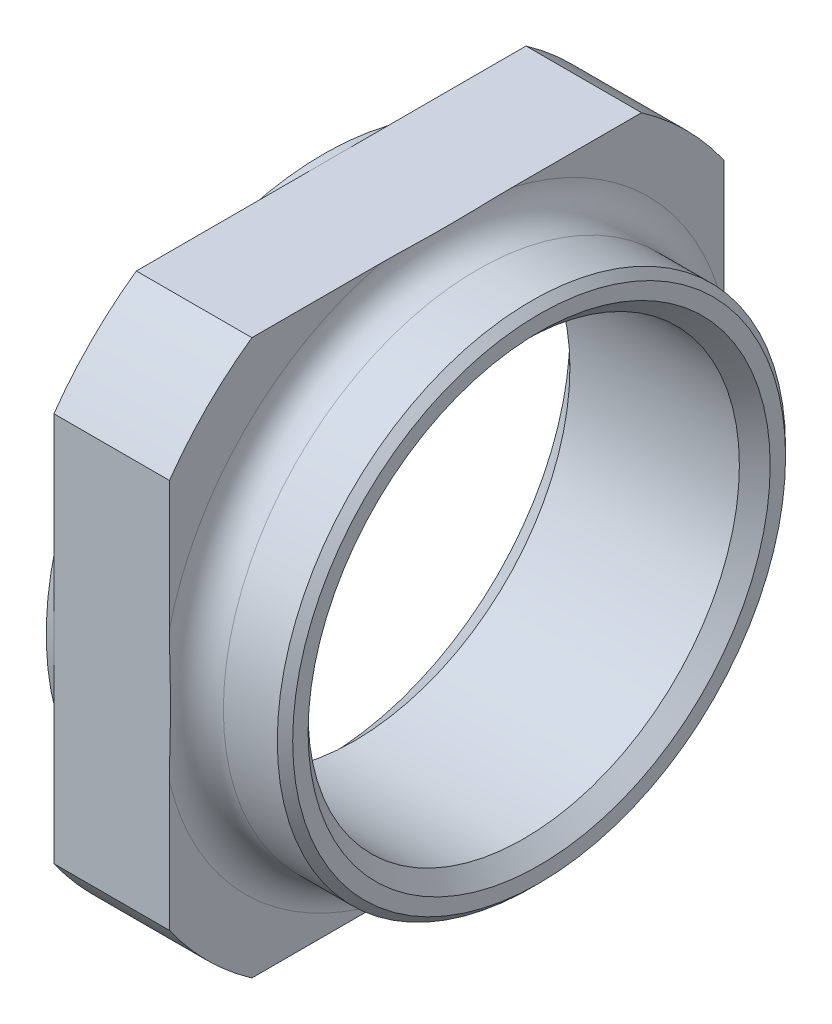
ISO-10303-21;
HEADER;
FILE_DESCRIPTION(('STEP AP214'),'2;1');
FILE_NAME('part.step','',(''),(''),'','','');
FILE_SCHEMA(('AUTOMOTIVE_DESIGN { 1 0 10303 214 1 1 1 1 }'));
ENDSEC;
DATA;
#1=APPLICATION_CONTEXT('core data for automotive mechanical design processes');
#2=APPLICATION_PROTOCOL_DEFINITION('international standard','automotive_design',2000,#1);
#3=PRODUCT_CONTEXT('',#1,'mechanical');
#4=PRODUCT('Part','Part','',(#3));
#5=PRODUCT_RELATED_PRODUCT_CATEGORY('part','',(#4));
#6=PRODUCT_DEFINITION_FORMATION('','',#4);
#7=PRODUCT_DEFINITION_CONTEXT('part definition',#1,'design');
#8=PRODUCT_DEFINITION('design','',#6,#7);
#9=PRODUCT_DEFINITION_SHAPE('','',#8);
#10=(LENGTH_UNIT() NAMED_UNIT(*) SI_UNIT(.MILLI.,.METRE.));
#11=(NAMED_UNIT(*) PLANE_ANGLE_UNIT() SI_UNIT($,.RADIAN.));
#12=(NAMED_UNIT(*) SI_UNIT($,.STERADIAN.) SOLID_ANGLE_UNIT());
#13=UNCERTAINTY_MEASURE_WITH_UNIT(LENGTH_MEASURE(1.E-05),#10,'distance_accuracy_value','');
#14=(GEOMETRIC_REPRESENTATION_CONTEXT(3) GLOBAL_UNCERTAINTY_ASSIGNED_CONTEXT((#13)) GLOBAL_UNIT_ASSIGNED_CONTEXT((#10,
#11,#12)) REPRESENTATION_CONTEXT('',''));
#15=CARTESIAN_POINT('',(0.,0.,0.));
#16=DIRECTION('',(0.,0.,1.));
#17=DIRECTION('',(1.,0.,0.));
#18=AXIS2_PLACEMENT_3D('',#15,#16,#17);
#19=CARTESIAN_POINT('',(88.9943089574791,18.4998225037,0.));
#20=DIRECTION('',(-1.,0.,0.));
#21=DIRECTION('',(0.,0.,1.));
#22=AXIS2_PLACEMENT_3D('',#19,#20,#21);
#23=PLANE('',#22);
#24=CARTESIAN_POINT('',(88.9943089574791,0.,0.));
#25=DIRECTION('',(1.,0.,0.));
#26=DIRECTION('',(0.,0.972982308144447,0.230879683034051));
#27=AXIS2_PLACEMENT_3D('',#24,#25,#26);
#28=CIRCLE('',#27,18.4998225037757);
#29=CARTESIAN_POINT('',(88.9943089574791,4.2712331558,18.));
#30=VERTEX_POINT('',#29);
#31=CARTESIAN_POINT('',(88.9943089574791,17.9999999997573,4.27123315580359));
#32=VERTEX_POINT('',#31);
#33=EDGE_CURVE('E107',#30,#32,#28,.F.);
#34=ORIENTED_EDGE('',*,*,#33,.T.);
#35=DIRECTION('',(0.,0.,1.));
#36=VECTOR('',#35,1.);
#37=CARTESIAN_POINT('',(88.9943089574791,17.9999999997,-18.));
#38=LINE('',#37,#36);
#39=CARTESIAN_POINT('',(88.9943089574791,17.9999999997,12.6488019276156));
#40=VERTEX_POINT('',#39);
#41=EDGE_CURVE('E145',#40,#32,#38,.F.);
#42=ORIENTED_EDGE('',*,*,#41,.F.);
#43=CARTESIAN_POINT('',(88.9943089574791,0.,0.));
#44=DIRECTION('',(1.,0.,0.));
#45=DIRECTION('',(0.,0.,-1.));
#46=AXIS2_PLACEMENT_3D('',#43,#44,#45);
#47=CIRCLE('',#46,21.9998225038);
#48=CARTESIAN_POINT('',(88.9943089574791,12.6488019274021,18.));
#49=VERTEX_POINT('',#48);
#50=EDGE_CURVE('E326',#49,#40,#47,.F.);
#51=ORIENTED_EDGE('',*,*,#50,.F.);
#52=DIRECTION('',(0.,1.,0.));
#53=VECTOR('',#52,1.);
#54=CARTESIAN_POINT('',(88.9943089574791,17.9999999997,18.));
#55=LINE('',#54,#53);
#56=EDGE_CURVE('E99',#30,#49,#55,.T.);
#57=ORIENTED_EDGE('',*,*,#56,.F.);
#58=EDGE_LOOP('',(#34,#42,#51,#57));
#59=FACE_BOUND('',#58,.T.);
#60=ADVANCED_FACE('F17',(#59),#23,.F.);
#61=CARTESIAN_POINT('',(88.9943089574791,18.4998225037,0.));
#62=DIRECTION('',(-1.,0.,0.));
#63=DIRECTION('',(0.,0.,1.));
#64=AXIS2_PLACEMENT_3D('',#61,#62,#63);
#65=PLANE('',#64);
#66=DIRECTION('',(0.,0.,-1.));
#67=VECTOR('',#66,1.);
#68=CARTESIAN_POINT('',(88.9943089574791,-18.,18.));
#69=LINE('',#68,#67);
#70=CARTESIAN_POINT('',(88.9943089574791,-18.,-12.6488019274021));
#71=VERTEX_POINT('',#70);
#72=CARTESIAN_POINT('',(88.9943089574791,-18.0000000000005,-4.2712331557901));
#73=VERTEX_POINT('',#72);
#74=EDGE_CURVE('E230',#71,#73,#69,.F.);
#75=ORIENTED_EDGE('',*,*,#74,.F.);
#76=CARTESIAN_POINT('',(88.9943089574791,0.,0.));
#77=DIRECTION('',(1.,0.,0.));
#78=DIRECTION('',(0.,0.,-1.));
#79=AXIS2_PLACEMENT_3D('',#76,#77,#78);
#80=CIRCLE('',#79,21.9998225038);
#81=CARTESIAN_POINT('',(88.9943089574791,-12.6488019273521,-18.));
#82=VERTEX_POINT('',#81);
#83=EDGE_CURVE('E220',#82,#71,#80,.F.);
#84=ORIENTED_EDGE('',*,*,#83,.F.);
#85=DIRECTION('',(0.,1.,0.));
#86=VECTOR('',#85,1.);
#87=CARTESIAN_POINT('',(88.9943089574791,-18.,-18.));
#88=LINE('',#87,#86);
#89=CARTESIAN_POINT('',(88.9943089574791,-4.2712331558,-18.));
#90=VERTEX_POINT('',#89);
#91=EDGE_CURVE('E233',#90,#82,#88,.F.);
#92=ORIENTED_EDGE('',*,*,#91,.F.);
#93=CARTESIAN_POINT('',(88.9943089574791,0.,0.));
#94=DIRECTION('',(1.,0.,0.));
#95=DIRECTION('',(0.,-0.972982308145312,-0.230879683030408));
#96=AXIS2_PLACEMENT_3D('',#93,#94,#95);
#97=CIRCLE('',#96,18.4998225037757);
#98=EDGE_CURVE('E344',#90,#73,#97,.F.);
#99=ORIENTED_EDGE('',*,*,#98,.T.);
#100=EDGE_LOOP('',(#75,#84,#92,#99));
#101=FACE_BOUND('',#100,.T.);
#102=ADVANCED_FACE('F343',(#101),#65,.F.);
#103=CARTESIAN_POINT('',(88.9943089574791,18.4998225037,0.));
#104=DIRECTION('',(-1.,0.,0.));
#105=DIRECTION('',(0.,0.,1.));
#106=AXIS2_PLACEMENT_3D('',#103,#104,#105);
#107=PLANE('',#106);
#108=CARTESIAN_POINT('',(88.9943089574791,0.,0.));
#109=DIRECTION('',(1.,0.,0.));
#110=DIRECTION('',(0.,0.,-1.));
#111=AXIS2_PLACEMENT_3D('',#108,#109,#110);
#112=CIRCLE('',#111,21.9998225038);
#113=CARTESIAN_POINT('',(88.9943089574791,-18.000000000001,12.6488019274028));
#114=VERTEX_POINT('',#113);
#115=CARTESIAN_POINT('',(88.9943089574791,-12.6488019273521,18.));
#116=VERTEX_POINT('',#115);
#117=EDGE_CURVE('E176',#114,#116,#112,.F.);
#118=ORIENTED_EDGE('',*,*,#117,.F.);
#119=DIRECTION('',(0.,0.,-1.));
#120=VECTOR('',#119,1.);
#121=CARTESIAN_POINT('',(88.9943089574791,-18.,18.));
#122=LINE('',#121,#120);
#123=CARTESIAN_POINT('',(88.9943089574791,-18.,4.27123315579));
#124=VERTEX_POINT('',#123);
#125=EDGE_CURVE('E243',#124,#114,#122,.F.);
#126=ORIENTED_EDGE('',*,*,#125,.F.);
#127=CARTESIAN_POINT('',(88.9943089574791,0.,0.));
#128=DIRECTION('',(1.,0.,0.));
#129=DIRECTION('',(0.,-0.877582561890723,0.479425538603562));
#130=AXIS2_PLACEMENT_3D('',#127,#128,#129);
#131=CIRCLE('',#130,18.4998225037734);
#132=CARTESIAN_POINT('',(88.9943089574791,-16.2351216273956,8.86928736795146));
#133=VERTEX_POINT('',#132);
#134=EDGE_CURVE('E457',#124,#133,#131,.F.);
#135=ORIENTED_EDGE('',*,*,#134,.T.);
#136=CARTESIAN_POINT('',(88.9943089574791,0.,0.));
#137=DIRECTION('',(1.,0.,0.));
#138=DIRECTION('',(0.,-0.23087968303092,0.97298230814519));
#139=AXIS2_PLACEMENT_3D('',#136,#137,#138);
#140=CIRCLE('',#139,18.4998225037952);
#141=CARTESIAN_POINT('',(88.9943089574791,-4.2712331558009,18.0000000000038));
#142=VERTEX_POINT('',#141);
#143=EDGE_CURVE('E153',#133,#142,#140,.F.);
#144=ORIENTED_EDGE('',*,*,#143,.T.);
#145=DIRECTION('',(0.,1.,0.));
#146=VECTOR('',#145,1.);
#147=CARTESIAN_POINT('',(88.9943089574791,17.9999999997,18.));
#148=LINE('',#147,#146);
#149=EDGE_CURVE('E253',#116,#142,#148,.T.);
#150=ORIENTED_EDGE('',*,*,#149,.F.);
#151=EDGE_LOOP('',(#118,#126,#135,#144,#150));
#152=FACE_BOUND('',#151,.T.);
#153=ADVANCED_FACE('F197',(#152),#107,.F.);
#154=CARTESIAN_POINT('',(88.9943089574791,18.4998225037,0.));
#155=DIRECTION('',(-1.,0.,0.));
#156=DIRECTION('',(0.,0.,1.));
#157=AXIS2_PLACEMENT_3D('',#154,#155,#156);
#158=PLANE('',#157);
#159=CARTESIAN_POINT('',(88.9943089574791,0.,0.));
#160=DIRECTION('',(1.,0.,0.));
#161=DIRECTION('',(0.,0.877582561890372,-0.479425538604203));
#162=AXIS2_PLACEMENT_3D('',#159,#160,#161);
#163=CIRCLE('',#162,18.4998225034815);
#164=CARTESIAN_POINT('',(88.9943089574791,17.9999999997,-4.27123315579));
#165=VERTEX_POINT('',#164);
#166=CARTESIAN_POINT('',(88.9943089574791,16.2351216273436,-8.86928736792842));
#167=VERTEX_POINT('',#166);
#168=EDGE_CURVE('E136',#165,#167,#163,.F.);
#169=ORIENTED_EDGE('',*,*,#168,.T.);
#170=CARTESIAN_POINT('',(88.9943089574791,0.,0.));
#171=DIRECTION('',(1.,0.,0.));
#172=DIRECTION('',(0.,0.23087968303092,-0.97298230814519));
#173=AXIS2_PLACEMENT_3D('',#170,#171,#172);
#174=CIRCLE('',#173,18.4998225037952);
#175=CARTESIAN_POINT('',(88.9943089574791,4.2712331558009,-18.0000000000038));
#176=VERTEX_POINT('',#175);
#177=EDGE_CURVE('E151',#167,#176,#174,.F.);
#178=ORIENTED_EDGE('',*,*,#177,.T.);
#179=DIRECTION('',(0.,1.,0.));
#180=VECTOR('',#179,1.);
#181=CARTESIAN_POINT('',(88.9943089574791,-18.,-18.));
#182=LINE('',#181,#180);
#183=CARTESIAN_POINT('',(88.9943089574791,12.6488019274021,-18.));
#184=VERTEX_POINT('',#183);
#185=EDGE_CURVE('E219',#184,#176,#182,.F.);
#186=ORIENTED_EDGE('',*,*,#185,.F.);
#187=CARTESIAN_POINT('',(88.9943089574791,0.,0.));
#188=DIRECTION('',(1.,0.,0.));
#189=DIRECTION('',(0.,0.,-1.));
#190=AXIS2_PLACEMENT_3D('',#187,#188,#189);
#191=CIRCLE('',#190,21.9998225038);
#192=CARTESIAN_POINT('',(88.9943089574791,17.9999999997,-12.6488019276156));
#193=VERTEX_POINT('',#192);
#194=EDGE_CURVE('E140',#193,#184,#191,.F.);
#195=ORIENTED_EDGE('',*,*,#194,.F.);
#196=DIRECTION('',(0.,0.,1.));
#197=VECTOR('',#196,1.);
#198=CARTESIAN_POINT('',(88.9943089574791,17.9999999997,-18.));
#199=LINE('',#198,#197);
#200=EDGE_CURVE('E132',#165,#193,#199,.F.);
#201=ORIENTED_EDGE('',*,*,#200,.F.);
#202=EDGE_LOOP('',(#169,#178,#186,#195,#201));
#203=FACE_BOUND('',#202,.T.);
#204=ADVANCED_FACE('F134',(#203),#158,.F.);
#205=CARTESIAN_POINT('',(87.9943089574491,0.,0.));
#206=DIRECTION('',(1.,0.,0.));
#207=DIRECTION('',(0.,0.,-1.));
#208=AXIS2_PLACEMENT_3D('',#205,#206,#207);
#209=CYLINDRICAL_SURFACE('',#208,21.9998225038);
#210=DIRECTION('',(1.,0.,0.));
#211=VECTOR('',#210,1.);
#212=CARTESIAN_POINT('',(81.4943089574791,17.9999999997,12.6488019274));
#213=LINE('',#212,#211);
#214=CARTESIAN_POINT('',(81.4943089574791,17.9999999997,12.6488019276156));
#215=VERTEX_POINT('',#214);
#216=EDGE_CURVE('E213',#215,#40,#213,.T.);
#217=ORIENTED_EDGE('',*,*,#216,.F.);
#218=CARTESIAN_POINT('',(81.4943089574791,0.,0.));
#219=DIRECTION('',(1.,0.,0.));
#220=DIRECTION('',(0.,0.,-1.));
#221=AXIS2_PLACEMENT_3D('',#218,#219,#220);
#222=CIRCLE('',#221,21.9998225038);
#223=CARTESIAN_POINT('',(81.4943089574791,12.6488019274021,18.));
#224=VERTEX_POINT('',#223);
#225=EDGE_CURVE('E435',#224,#215,#222,.F.);
#226=ORIENTED_EDGE('',*,*,#225,.F.);
#227=DIRECTION('',(1.,0.,0.));
#228=VECTOR('',#227,1.);
#229=CARTESIAN_POINT('',(81.4943089574791,12.6488019274,18.));
#230=LINE('',#229,#228);
#231=EDGE_CURVE('E160',#49,#224,#230,.F.);
#232=ORIENTED_EDGE('',*,*,#231,.F.);
#233=ORIENTED_EDGE('',*,*,#50,.T.);
#234=EDGE_LOOP('',(#217,#226,#232,#233));
#235=FACE_BOUND('',#234,.T.);
#236=ADVANCED_FACE('F189',(#235),#209,.T.);
#237=CARTESIAN_POINT('',(87.9943089574491,0.,0.));
#238=DIRECTION('',(1.,0.,0.));
#239=DIRECTION('',(0.,0.,-1.));
#240=AXIS2_PLACEMENT_3D('',#237,#238,#239);
#241=CYLINDRICAL_SURFACE('',#240,21.9998225038);
#242=DIRECTION('',(1.,0.,0.));
#243=VECTOR('',#242,1.);
#244=CARTESIAN_POINT('',(81.4943089574791,17.9999999997,-12.6488019274));
#245=LINE('',#244,#243);
#246=CARTESIAN_POINT('',(81.4943089574791,17.9999999997,-12.6488019276156));
#247=VERTEX_POINT('',#246);
#248=EDGE_CURVE('E144',#193,#247,#245,.F.);
#249=ORIENTED_EDGE('',*,*,#248,.F.);
#250=ORIENTED_EDGE('',*,*,#194,.T.);
#251=DIRECTION('',(-1.,0.,0.));
#252=VECTOR('',#251,1.);
#253=CARTESIAN_POINT('',(81.4943089574791,12.6488019274,-18.));
#254=LINE('',#253,#252);
#255=CARTESIAN_POINT('',(81.4943089574791,12.6488019274021,-18.));
#256=VERTEX_POINT('',#255);
#257=EDGE_CURVE('E216',#256,#184,#254,.F.);
#258=ORIENTED_EDGE('',*,*,#257,.F.);
#259=CARTESIAN_POINT('',(81.4943089574791,0.,0.));
#260=DIRECTION('',(1.,0.,0.));
#261=DIRECTION('',(0.,0.,-1.));
#262=AXIS2_PLACEMENT_3D('',#259,#260,#261);
#263=CIRCLE('',#262,21.9998225038);
#264=EDGE_CURVE('E445',#247,#256,#263,.F.);
#265=ORIENTED_EDGE('',*,*,#264,.F.);
#266=EDGE_LOOP('',(#249,#250,#258,#265));
#267=FACE_BOUND('',#266,.T.);
#268=ADVANCED_FACE('F185',(#267),#241,.T.);
#269=CARTESIAN_POINT('',(81.4943089574791,17.9999999997,-18.));
#270=DIRECTION('',(0.,1.,0.));
#271=DIRECTION('',(0.,0.,1.));
#272=AXIS2_PLACEMENT_3D('',#269,#270,#271);
#273=PLANE('',#272);
#274=ORIENTED_EDGE('',*,*,#200,.T.);
#275=ORIENTED_EDGE('',*,*,#248,.T.);
#276=DIRECTION('',(0.,0.,1.));
#277=VECTOR('',#276,1.);
#278=CARTESIAN_POINT('',(81.4943089574791,17.9999999997,0.));
#279=LINE('',#278,#277);
#280=CARTESIAN_POINT('',(81.4943089574791,17.99999999985,0.));
#281=VERTEX_POINT('',#280);
#282=EDGE_CURVE('E420',#281,#247,#279,.F.);
#283=ORIENTED_EDGE('',*,*,#282,.F.);
#284=DIRECTION('',(0.,0.,1.));
#285=VECTOR('',#284,1.);
#286=CARTESIAN_POINT('',(81.4943089574791,17.9999999997,0.));
#287=LINE('',#286,#285);
#288=EDGE_CURVE('E432',#215,#281,#287,.F.);
#289=ORIENTED_EDGE('',*,*,#288,.F.);
#290=ORIENTED_EDGE('',*,*,#216,.T.);
#291=ORIENTED_EDGE('',*,*,#41,.T.);
#292=CARTESIAN_POINT('',(88.9943089574791,17.9999999997,4.27123315580359));
#293=CARTESIAN_POINT('',(88.99435019783,17.9999999997,4.04896092008068));
#294=CARTESIAN_POINT('',(88.9962845732207,17.9999999997,3.82670739047402));
#295=CARTESIAN_POINT('',(89.0024960753966,17.9999999997,3.3822148615335));
#296=CARTESIAN_POINT('',(89.006773367345,17.9999999997,3.15997586432884));
#297=CARTESIAN_POINT('',(89.0162271015666,17.9999999997,2.71550531518572));
#298=CARTESIAN_POINT('',(89.0214036067074,17.9999999997,2.49327376485515));
#299=CARTESIAN_POINT('',(89.0314975168835,17.9999999997,2.04885052109975));
#300=CARTESIAN_POINT('',(89.0364149761852,17.9999999997,1.82665882912278));
#301=CARTESIAN_POINT('',(89.0450680545286,17.9999999997,1.38226607651802));
#302=CARTESIAN_POINT('',(89.0488037529039,17.9999999997,1.16006501752107));
#303=CARTESIAN_POINT('',(89.0544627468218,17.9999999997,0.715655201368642));
#304=CARTESIAN_POINT('',(89.0563861780582,17.9999999997,0.493446446035536));
#305=CARTESIAN_POINT('',(89.0582206929058,17.9999999997,0.0188928837273769));
#306=CARTESIAN_POINT('',(89.0578235939723,17.9999999997,-0.233453236258142));
#307=CARTESIAN_POINT('',(89.054359585888,17.9999999997,-0.738145171762012));
#308=CARTESIAN_POINT('',(89.0512924711596,17.9999999997,-0.990490985760689));
#309=CARTESIAN_POINT('',(89.0431343782079,17.9999999997,-1.49517104805072));
#310=CARTESIAN_POINT('',(89.0380432112177,17.9999999997,-1.7475052930673));
#311=CARTESIAN_POINT('',(89.0269914893723,17.9999999997,-2.25221414608471));
#312=CARTESIAN_POINT('',(89.0210307235408,17.9999999997,-2.50458874899216));
#313=CARTESIAN_POINT('',(89.0098348348964,17.9999999997,-3.00933329503236));
#314=CARTESIAN_POINT('',(89.0045996446844,17.9999999997,-3.26170323641765));
#315=CARTESIAN_POINT('',(88.9987800203382,17.9999999997,-3.64027423085676));
#316=CARTESIAN_POINT('',(88.9971790472747,17.9999999997,-3.76645827354891));
#317=CARTESIAN_POINT('',(88.9949451971256,17.9999999997,-4.01883841942357));
#318=CARTESIAN_POINT('',(88.9943123496788,17.9999999997,-4.14503452285706));
#319=CARTESIAN_POINT('',(88.9943089574791,17.9999999997,-4.27123315578999));
#320=B_SPLINE_CURVE_WITH_KNOTS('',3,(#292,#293,#294,#295,#296,#297,#298,#299,#300,#301,#302,
#303,#304,#305,#306,#307,#308,#309,#310,#311,#312,#313,#314,#315,#316,#317,#318,#319),
.UNSPECIFIED.,.F.,.F.,(4,2,2,2,2,2,2,2,2,2,2,2,2,4),(0.,0.666783556745442,1.33361412424198,
2.00049133130867,2.66722827742165,3.33392045484061,4.00056270960086,4.7575862331326,
5.51466804880852,6.27182048795056,7.02915692886438,7.78642297300102,8.16500218338486,
8.54359298359863),.UNSPECIFIED.);
#321=EDGE_CURVE('E149',#32,#165,#320,.T.);
#322=ORIENTED_EDGE('',*,*,#321,.T.);
#323=EDGE_LOOP('',(#274,#275,#283,#289,#290,#291,#322));
#324=FACE_BOUND('',#323,.T.);
#325=ADVANCED_FACE('F156',(#324),#273,.T.);
#326=CARTESIAN_POINT('',(87.9943089574491,0.,0.));
#327=DIRECTION('',(1.,0.,0.));
#328=DIRECTION('',(0.,0.,-1.));
#329=AXIS2_PLACEMENT_3D('',#326,#327,#328);
#330=CYLINDRICAL_SURFACE('',#329,21.9998225038);
#331=DIRECTION('',(1.,0.,0.));
#332=VECTOR('',#331,1.);
#333=CARTESIAN_POINT('',(81.4943089574791,-18.,-12.6488019274));
#334=LINE('',#333,#332);
#335=CARTESIAN_POINT('',(81.4943089574791,-18.,-12.6488019274021));
#336=VERTEX_POINT('',#335);
#337=EDGE_CURVE('E227',#336,#71,#334,.T.);
#338=ORIENTED_EDGE('',*,*,#337,.F.);
#339=CARTESIAN_POINT('',(81.4943089574791,0.,0.));
#340=DIRECTION('',(1.,0.,0.));
#341=DIRECTION('',(0.,0.,-1.));
#342=AXIS2_PLACEMENT_3D('',#339,#340,#341);
#343=CIRCLE('',#342,21.9998225038);
#344=CARTESIAN_POINT('',(81.4943089574791,-12.6488019273521,-18.));
#345=VERTEX_POINT('',#344);
#346=EDGE_CURVE('E442',#345,#336,#343,.F.);
#347=ORIENTED_EDGE('',*,*,#346,.F.);
#348=DIRECTION('',(-1.,0.,0.));
#349=VECTOR('',#348,1.);
#350=CARTESIAN_POINT('',(81.4943089574791,-12.6488019273,-18.));
#351=LINE('',#350,#349);
#352=EDGE_CURVE('E231',#82,#345,#351,.T.);
#353=ORIENTED_EDGE('',*,*,#352,.F.);
#354=ORIENTED_EDGE('',*,*,#83,.T.);
#355=EDGE_LOOP('',(#338,#347,#353,#354));
#356=FACE_BOUND('',#355,.T.);
#357=ADVANCED_FACE('F184',(#356),#330,.T.);
#358=CARTESIAN_POINT('',(81.4943089574791,-18.,-18.));
#359=DIRECTION('',(0.,0.,-1.));
#360=DIRECTION('',(-1.,0.,0.));
#361=AXIS2_PLACEMENT_3D('',#358,#359,#360);
#362=PLANE('',#361);
#363=ORIENTED_EDGE('',*,*,#91,.T.);
#364=ORIENTED_EDGE('',*,*,#352,.T.);
#365=DIRECTION('',(0.,1.,0.));
#366=VECTOR('',#365,1.);
#367=CARTESIAN_POINT('',(81.4943089574791,21.9998225037,-18.));
#368=LINE('',#367,#366);
#369=CARTESIAN_POINT('',(81.4943089574791,0.,-18.));
#370=VERTEX_POINT('',#369);
#371=EDGE_CURVE('E486',#370,#345,#368,.F.);
#372=ORIENTED_EDGE('',*,*,#371,.F.);
#373=DIRECTION('',(0.,1.,0.));
#374=VECTOR('',#373,1.);
#375=CARTESIAN_POINT('',(81.4943089574791,21.9998225037,-18.));
#376=LINE('',#375,#374);
#377=EDGE_CURVE('E423',#256,#370,#376,.F.);
#378=ORIENTED_EDGE('',*,*,#377,.F.);
#379=ORIENTED_EDGE('',*,*,#257,.T.);
#380=ORIENTED_EDGE('',*,*,#185,.T.);
#381=CARTESIAN_POINT('',(88.9943089574791,4.2712331558009,-18.));
#382=CARTESIAN_POINT('',(88.9943501978226,4.04896092007794,-18.));
#383=CARTESIAN_POINT('',(88.9962845732062,3.82670739047117,-18.));
#384=CARTESIAN_POINT('',(89.0024960753691,3.38221486153044,-18.));
#385=CARTESIAN_POINT('',(89.0067733673116,3.15997586432568,-18.));
#386=CARTESIAN_POINT('',(89.0162271015221,2.71550531518236,-18.));
#387=CARTESIAN_POINT('',(89.0214036066578,2.49327376485172,-18.));
#388=CARTESIAN_POINT('',(89.0314975168252,2.04885052109607,-18.));
#389=CARTESIAN_POINT('',(89.036414976123,1.82665882911894,-18.));
#390=CARTESIAN_POINT('',(89.0450680544599,1.38226607651387,-18.));
#391=CARTESIAN_POINT('',(89.0488037528326,1.16006501751678,-18.));
#392=CARTESIAN_POINT('',(89.0544627467466,0.715655201364086,-18.));
#393=CARTESIAN_POINT('',(89.0563861779817,0.493446446030854,-18.));
#394=CARTESIAN_POINT('',(89.0582206928281,0.0188928837222654,-18.));
#395=CARTESIAN_POINT('',(89.0578235938948,-0.233453236263556,-18.));
#396=CARTESIAN_POINT('',(89.0543595858128,-0.738145171768034,-18.));
#397=CARTESIAN_POINT('',(89.0512924710864,-0.990490985767017,-18.));
#398=CARTESIAN_POINT('',(89.0431343781405,-1.49517104805768,-18.));
#399=CARTESIAN_POINT('',(89.038043211154,-1.74750529307459,-18.));
#400=CARTESIAN_POINT('',(89.0269914893175,-2.25221414609257,-18.));
#401=CARTESIAN_POINT('',(89.0210307234912,-2.50458874900026,-18.));
#402=CARTESIAN_POINT('',(89.0098348348587,-3.00933329504097,-18.));
#403=CARTESIAN_POINT('',(89.0045996446533,-3.26170323642654,-18.));
#404=CARTESIAN_POINT('',(88.998780020318,-3.64027423086607,-18.));
#405=CARTESIAN_POINT('',(88.9971790472584,-3.76645827355837,-18.));
#406=CARTESIAN_POINT('',(88.9949451971172,-4.01883841943333,-18.));
#407=CARTESIAN_POINT('',(88.9943123496745,-4.14503452286695,-18.));
#408=CARTESIAN_POINT('',(88.9943089574791,-4.2712331558,-18.));
#409=B_SPLINE_CURVE_WITH_KNOTS('',3,(#381,#382,#383,#384,#385,#386,#387,#388,#389,#390,#391,
#392,#393,#394,#395,#396,#397,#398,#399,#400,#401,#402,#403,#404,#405,#406,#407,#408),
.UNSPECIFIED.,.F.,.F.,(4,2,2,2,2,2,2,2,2,2,2,2,2,4),(0.,0.666783556745581,1.33361412424207,
2.00049133130865,2.66722827742188,3.33392045484114,4.00056270960175,4.75758623313441,
5.5146680488112,6.27182048795401,7.02915692886817,7.78642297300522,8.16500218338939,
8.5435929836035),.UNSPECIFIED.);
#410=EDGE_CURVE('E455',#176,#90,#409,.T.);
#411=ORIENTED_EDGE('',*,*,#410,.T.);
#412=EDGE_LOOP('',(#363,#364,#372,#378,#379,#380,#411));
#413=FACE_BOUND('',#412,.T.);
#414=ADVANCED_FACE('F499',(#413),#362,.T.);
#415=CARTESIAN_POINT('',(81.4943089574791,-18.,18.));
#416=DIRECTION('',(0.,-1.,0.));
#417=DIRECTION('',(0.,0.,-1.));
#418=AXIS2_PLACEMENT_3D('',#415,#416,#417);
#419=PLANE('',#418);
#420=ORIENTED_EDGE('',*,*,#125,.T.);
#421=DIRECTION('',(1.,0.,0.));
#422=VECTOR('',#421,1.);
#423=CARTESIAN_POINT('',(87.9943089574491,-18.000000000002,12.6488019274014));
#424=LINE('',#423,#422);
#425=CARTESIAN_POINT('',(81.4943089574791,-18.000000000001,12.6488019274028));
#426=VERTEX_POINT('',#425);
#427=EDGE_CURVE('E247',#426,#114,#424,.T.);
#428=ORIENTED_EDGE('',*,*,#427,.F.);
#429=DIRECTION('',(0.,0.,1.));
#430=VECTOR('',#429,1.);
#431=CARTESIAN_POINT('',(81.4943089574791,-18.,0.));
#432=LINE('',#431,#430);
#433=CARTESIAN_POINT('',(81.4943089574791,-18.,0.));
#434=VERTEX_POINT('',#433);
#435=EDGE_CURVE('E485',#434,#426,#432,.T.);
#436=ORIENTED_EDGE('',*,*,#435,.F.);
#437=DIRECTION('',(0.,0.,1.));
#438=VECTOR('',#437,1.);
#439=CARTESIAN_POINT('',(81.4943089574791,-18.,0.));
#440=LINE('',#439,#438);
#441=EDGE_CURVE('E38',#336,#434,#440,.T.);
#442=ORIENTED_EDGE('',*,*,#441,.F.);
#443=ORIENTED_EDGE('',*,*,#337,.T.);
#444=ORIENTED_EDGE('',*,*,#74,.T.);
#445=CARTESIAN_POINT('',(88.9943089574791,-18.,-4.2712331557901));
#446=CARTESIAN_POINT('',(88.9943501978226,-18.,-4.04896092006714));
#447=CARTESIAN_POINT('',(88.9962845732063,-18.,-3.82670739046037));
#448=CARTESIAN_POINT('',(89.0024960753693,-18.,-3.38221486151964));
#449=CARTESIAN_POINT('',(89.0067733673118,-18.,-3.15997586431488));
#450=CARTESIAN_POINT('',(89.0162271015224,-18.,-2.71550531517157));
#451=CARTESIAN_POINT('',(89.0214036066581,-18.,-2.49327376484093));
#452=CARTESIAN_POINT('',(89.0314975168254,-18.,-2.04885052108528));
#453=CARTESIAN_POINT('',(89.0364149761232,-18.,-1.82665882910815));
#454=CARTESIAN_POINT('',(89.0450680544601,-18.,-1.38226607650308));
#455=CARTESIAN_POINT('',(89.0488037528327,-18.,-1.16006501750599));
#456=CARTESIAN_POINT('',(89.0544627467467,-18.,-0.715655201353302));
#457=CARTESIAN_POINT('',(89.0563861779818,-18.,-0.493446446020072));
#458=CARTESIAN_POINT('',(89.0582206928281,-18.,-0.0188928837126378));
#459=CARTESIAN_POINT('',(89.0578235938948,-18.,0.23345323627203));
#460=CARTESIAN_POINT('',(89.0543595858127,-18.,0.738145171774199));
#461=CARTESIAN_POINT('',(89.0512924710863,-18.,0.990490985772028));
#462=CARTESIAN_POINT('',(89.0431343781404,-18.,1.49517104806039));
#463=CARTESIAN_POINT('',(89.0380432111539,-18.,1.74750529307614));
#464=CARTESIAN_POINT('',(89.0269914893175,-18.,2.2522141460918));
#465=CARTESIAN_POINT('',(89.0210307234912,-18.,2.50458874899834));
#466=CARTESIAN_POINT('',(89.0098348348588,-18.,3.00933329503674));
#467=CARTESIAN_POINT('',(89.0045996446534,-18.,3.26170323642116));
#468=CARTESIAN_POINT('',(88.9987800203181,-18.,3.64027423085896));
#469=CARTESIAN_POINT('',(88.9971790472584,-18.,3.76645827355068));
#470=CARTESIAN_POINT('',(88.9949451971172,-18.,4.01883841942449));
#471=CARTESIAN_POINT('',(88.9943123496745,-18.,4.14503452285753));
#472=CARTESIAN_POINT('',(88.9943089574791,-18.,4.27123315579));
#473=B_SPLINE_CURVE_WITH_KNOTS('',3,(#445,#446,#447,#448,#449,#450,#451,#452,#453,#454,#455,
#456,#457,#458,#459,#460,#461,#462,#463,#464,#465,#466,#467,#468,#469,#470,#471,#472),
.UNSPECIFIED.,.F.,.F.,(4,2,2,2,2,2,2,2,2,2,2,2,2,4),(0.,0.666783556745579,1.33361412424207,
2.00049133130864,2.66722827742187,3.33392045484113,4.00056270960173,4.75758623313093,
5.51466804880425,6.2718204879436,7.02915692885429,7.78642297298788,8.16500218337032,
8.5435929835827),.UNSPECIFIED.);
#474=EDGE_CURVE('E346',#73,#124,#473,.T.);
#475=ORIENTED_EDGE('',*,*,#474,.T.);
#476=EDGE_LOOP('',(#420,#428,#436,#442,#443,#444,#475));
#477=FACE_BOUND('',#476,.T.);
#478=ADVANCED_FACE('F338',(#477),#419,.T.);
#479=CARTESIAN_POINT('',(87.9943089574491,0.,0.));
#480=DIRECTION('',(1.,0.,0.));
#481=DIRECTION('',(0.,0.,-1.));
#482=AXIS2_PLACEMENT_3D('',#479,#480,#481);
#483=CYLINDRICAL_SURFACE('',#482,21.9998225038);
#484=ORIENTED_EDGE('',*,*,#427,.T.);
#485=ORIENTED_EDGE('',*,*,#117,.T.);
#486=DIRECTION('',(1.,0.,0.));
#487=VECTOR('',#486,1.);
#488=CARTESIAN_POINT('',(81.4943089574791,-12.6488019273,18.));
#489=LINE('',#488,#487);
#490=CARTESIAN_POINT('',(81.4943089574791,-12.6488019273521,18.));
#491=VERTEX_POINT('',#490);
#492=EDGE_CURVE('E250',#491,#116,#489,.T.);
#493=ORIENTED_EDGE('',*,*,#492,.F.);
#494=CARTESIAN_POINT('',(81.4943089574791,0.,0.));
#495=DIRECTION('',(1.,0.,0.));
#496=DIRECTION('',(0.,0.,-1.));
#497=AXIS2_PLACEMENT_3D('',#494,#495,#496);
#498=CIRCLE('',#497,21.9998225038);
#499=EDGE_CURVE('E484',#426,#491,#498,.F.);
#500=ORIENTED_EDGE('',*,*,#499,.F.);
#501=EDGE_LOOP('',(#484,#485,#493,#500));
#502=FACE_BOUND('',#501,.T.);
#503=ADVANCED_FACE('F483',(#502),#483,.T.);
#504=CARTESIAN_POINT('',(81.4943089574791,17.9999999997,18.));
#505=DIRECTION('',(0.,0.,1.));
#506=DIRECTION('',(1.,0.,0.));
#507=AXIS2_PLACEMENT_3D('',#504,#505,#506);
#508=PLANE('',#507);
#509=ORIENTED_EDGE('',*,*,#56,.T.);
#510=ORIENTED_EDGE('',*,*,#231,.T.);
#511=DIRECTION('',(0.,1.,0.));
#512=VECTOR('',#511,1.);
#513=CARTESIAN_POINT('',(81.4943089574791,21.9998225037,18.));
#514=LINE('',#513,#512);
#515=CARTESIAN_POINT('',(81.4943089574791,0.,18.));
#516=VERTEX_POINT('',#515);
#517=EDGE_CURVE('E437',#516,#224,#514,.T.);
#518=ORIENTED_EDGE('',*,*,#517,.F.);
#519=DIRECTION('',(0.,1.,0.));
#520=VECTOR('',#519,1.);
#521=CARTESIAN_POINT('',(81.4943089574791,21.9998225037,18.));
#522=LINE('',#521,#520);
#523=EDGE_CURVE('E480',#491,#516,#522,.T.);
#524=ORIENTED_EDGE('',*,*,#523,.F.);
#525=ORIENTED_EDGE('',*,*,#492,.T.);
#526=ORIENTED_EDGE('',*,*,#149,.T.);
#527=CARTESIAN_POINT('',(88.9943089574791,-4.2712331558009,18.));
#528=CARTESIAN_POINT('',(88.9943501978226,-4.04896092007794,18.));
#529=CARTESIAN_POINT('',(88.9962845732062,-3.82670739047117,18.));
#530=CARTESIAN_POINT('',(89.0024960753691,-3.38221486153043,18.));
#531=CARTESIAN_POINT('',(89.0067733673116,-3.15997586432568,18.));
#532=CARTESIAN_POINT('',(89.0162271015221,-2.71550531518236,18.));
#533=CARTESIAN_POINT('',(89.0214036066578,-2.49327376485172,18.));
#534=CARTESIAN_POINT('',(89.0314975168252,-2.04885052109607,18.));
#535=CARTESIAN_POINT('',(89.036414976123,-1.82665882911893,18.));
#536=CARTESIAN_POINT('',(89.0450680544599,-1.38226607651387,18.));
#537=CARTESIAN_POINT('',(89.0488037528326,-1.16006501751678,18.));
#538=CARTESIAN_POINT('',(89.0544627467466,-0.715655201364084,18.));
#539=CARTESIAN_POINT('',(89.0563861779817,-0.493446446030852,18.));
#540=CARTESIAN_POINT('',(89.0582206928281,-0.0188928837222639,18.));
#541=CARTESIAN_POINT('',(89.0578235938948,0.233453236263558,18.));
#542=CARTESIAN_POINT('',(89.0543595858128,0.738145171768035,18.));
#543=CARTESIAN_POINT('',(89.0512924710864,0.990490985767018,18.));
#544=CARTESIAN_POINT('',(89.0431343781405,1.49517104805768,18.));
#545=CARTESIAN_POINT('',(89.038043211154,1.74750529307459,18.));
#546=CARTESIAN_POINT('',(89.0269914893175,2.25221414609257,18.));
#547=CARTESIAN_POINT('',(89.0210307234912,2.50458874900026,18.));
#548=CARTESIAN_POINT('',(89.0098348348587,3.00933329504097,18.));
#549=CARTESIAN_POINT('',(89.0045996446533,3.26170323642654,18.));
#550=CARTESIAN_POINT('',(88.998780020318,3.64027423086607,18.));
#551=CARTESIAN_POINT('',(88.9971790472584,3.76645827355837,18.));
#552=CARTESIAN_POINT('',(88.9949451971172,4.01883841943333,18.));
#553=CARTESIAN_POINT('',(88.9943123496745,4.14503452286695,18.));
#554=CARTESIAN_POINT('',(88.9943089574791,4.2712331558,18.));
#555=B_SPLINE_CURVE_WITH_KNOTS('',3,(#527,#528,#529,#530,#531,#532,#533,#534,#535,#536,#537,
#538,#539,#540,#541,#542,#543,#544,#545,#546,#547,#548,#549,#550,#551,#552,#553,#554),
.UNSPECIFIED.,.F.,.F.,(4,2,2,2,2,2,2,2,2,2,2,2,2,4),(0.,0.666783556745583,1.33361412424207,
2.00049133130865,2.66722827742188,3.33392045484114,4.00056270960175,4.75758623313441,
5.5146680488112,6.27182048795401,7.02915692886817,7.78642297300522,8.16500218338939,
8.5435929836035),.UNSPECIFIED.);
#556=EDGE_CURVE('E347',#142,#30,#555,.T.);
#557=ORIENTED_EDGE('',*,*,#556,.T.);
#558=EDGE_LOOP('',(#509,#510,#518,#524,#525,#526,#557));
#559=FACE_BOUND('',#558,.T.);
#560=ADVANCED_FACE('F269',(#559),#508,.T.);
#561=CARTESIAN_POINT('',(90.9943089574791,0.,0.));
#562=DIRECTION('',(-1.,0.,0.));
#563=DIRECTION('',(0.,0.877582561890372,-0.479425538604204));
#564=AXIS2_PLACEMENT_3D('',#561,#562,#563);
#565=TOROIDAL_SURFACE('',#564,18.4998225038,2.);
#566=CARTESIAN_POINT('',(90.9943089574791,0.,0.));
#567=DIRECTION('',(1.,0.,0.));
#568=DIRECTION('',(0.,0.,-1.));
#569=AXIS2_PLACEMENT_3D('',#566,#567,#568);
#570=CIRCLE('',#569,16.4998225038);
#571=CARTESIAN_POINT('',(90.9943089574791,0.,-16.4998225038));
#572=VERTEX_POINT('',#571);
#573=EDGE_CURVE('E263',#572,#572,#570,.T.);
#574=ORIENTED_EDGE('',*,*,#573,.F.);
#575=EDGE_LOOP('',(#574));
#576=FACE_BOUND('',#575,.T.);
#577=ORIENTED_EDGE('',*,*,#177,.F.);
#578=ORIENTED_EDGE('',*,*,#168,.F.);
#579=ORIENTED_EDGE('',*,*,#321,.F.);
#580=ORIENTED_EDGE('',*,*,#33,.F.);
#581=ORIENTED_EDGE('',*,*,#556,.F.);
#582=ORIENTED_EDGE('',*,*,#143,.F.);
#583=ORIENTED_EDGE('',*,*,#134,.F.);
#584=ORIENTED_EDGE('',*,*,#474,.F.);
#585=ORIENTED_EDGE('',*,*,#98,.F.);
#586=ORIENTED_EDGE('',*,*,#410,.F.);
#587=EDGE_LOOP('',(#577,#578,#579,#580,#581,#582,#583,#584,#585,#586));
#588=FACE_BOUND('',#587,.T.);
#589=ADVANCED_FACE('F148',(#576,#588),#565,.F.);
#590=CARTESIAN_POINT('',(81.4943089574791,21.9998225037,0.));
#591=DIRECTION('',(-1.,0.,0.));
#592=DIRECTION('',(0.,0.,1.));
#593=AXIS2_PLACEMENT_3D('',#590,#591,#592);
#594=PLANE('',#593);
#595=CARTESIAN_POINT('',(81.4943089574791,0.,0.));
#596=DIRECTION('',(1.,0.,0.));
#597=DIRECTION('',(0.,0.,-1.));
#598=AXIS2_PLACEMENT_3D('',#595,#596,#597);
#599=CIRCLE('',#598,18.);
#600=EDGE_CURVE('E428',#516,#281,#599,.F.);
#601=ORIENTED_EDGE('',*,*,#600,.F.);
#602=ORIENTED_EDGE('',*,*,#517,.T.);
#603=ORIENTED_EDGE('',*,*,#225,.T.);
#604=ORIENTED_EDGE('',*,*,#288,.T.);
#605=EDGE_LOOP('',(#601,#602,#603,#604));
#606=FACE_BOUND('',#605,.T.);
#607=ADVANCED_FACE('F268',(#606),#594,.T.);
#608=CARTESIAN_POINT('',(81.4943089574791,21.9998225037,0.));
#609=DIRECTION('',(-1.,0.,0.));
#610=DIRECTION('',(0.,0.,1.));
#611=AXIS2_PLACEMENT_3D('',#608,#609,#610);
#612=PLANE('',#611);
#613=CARTESIAN_POINT('',(81.4943089574791,0.,0.));
#614=DIRECTION('',(1.,0.,0.));
#615=DIRECTION('',(0.,0.,-1.));
#616=AXIS2_PLACEMENT_3D('',#613,#614,#615);
#617=CIRCLE('',#616,18.);
#618=EDGE_CURVE('E417',#281,#370,#617,.F.);
#619=ORIENTED_EDGE('',*,*,#618,.F.);
#620=ORIENTED_EDGE('',*,*,#282,.T.);
#621=ORIENTED_EDGE('',*,*,#264,.T.);
#622=ORIENTED_EDGE('',*,*,#377,.T.);
#623=EDGE_LOOP('',(#619,#620,#621,#622));
#624=FACE_BOUND('',#623,.T.);
#625=ADVANCED_FACE('F408',(#624),#612,.T.);
#626=CARTESIAN_POINT('',(81.4943089574791,21.9998225037,0.));
#627=DIRECTION('',(-1.,0.,0.));
#628=DIRECTION('',(0.,0.,1.));
#629=AXIS2_PLACEMENT_3D('',#626,#627,#628);
#630=PLANE('',#629);
#631=CARTESIAN_POINT('',(81.4943089574791,0.,0.));
#632=DIRECTION('',(1.,0.,0.));
#633=DIRECTION('',(0.,0.,-1.));
#634=AXIS2_PLACEMENT_3D('',#631,#632,#633);
#635=CIRCLE('',#634,18.);
#636=EDGE_CURVE('E427',#370,#434,#635,.F.);
#637=ORIENTED_EDGE('',*,*,#636,.F.);
#638=ORIENTED_EDGE('',*,*,#371,.T.);
#639=ORIENTED_EDGE('',*,*,#346,.T.);
#640=ORIENTED_EDGE('',*,*,#441,.T.);
#641=EDGE_LOOP('',(#637,#638,#639,#640));
#642=FACE_BOUND('',#641,.T.);
#643=ADVANCED_FACE('F405',(#642),#630,.T.);
#644=CARTESIAN_POINT('',(81.4943089574791,21.9998225037,0.));
#645=DIRECTION('',(-1.,0.,0.));
#646=DIRECTION('',(0.,0.,1.));
#647=AXIS2_PLACEMENT_3D('',#644,#645,#646);
#648=PLANE('',#647);
#649=ORIENTED_EDGE('',*,*,#523,.T.);
#650=CARTESIAN_POINT('',(81.4943089574791,0.,0.));
#651=DIRECTION('',(1.,0.,0.));
#652=DIRECTION('',(0.,0.,-1.));
#653=AXIS2_PLACEMENT_3D('',#650,#651,#652);
#654=CIRCLE('',#653,18.);
#655=EDGE_CURVE('E439',#434,#516,#654,.F.);
#656=ORIENTED_EDGE('',*,*,#655,.F.);
#657=ORIENTED_EDGE('',*,*,#435,.T.);
#658=ORIENTED_EDGE('',*,*,#499,.T.);
#659=EDGE_LOOP('',(#649,#656,#657,#658));
#660=FACE_BOUND('',#659,.T.);
#661=ADVANCED_FACE('F401',(#660),#648,.T.);
#662=CARTESIAN_POINT('',(87.9943089574491,0.,0.));
#663=DIRECTION('',(1.,0.,0.));
#664=DIRECTION('',(0.,0.,-1.));
#665=AXIS2_PLACEMENT_3D('',#662,#663,#664);
#666=CYLINDRICAL_SURFACE('',#665,16.4998225038);
#667=ORIENTED_EDGE('',*,*,#573,.T.);
#668=EDGE_LOOP('',(#667));
#669=FACE_BOUND('',#668,.T.);
#670=CARTESIAN_POINT('',(94.4943089575301,0.,0.));
#671=DIRECTION('',(-1.,0.,0.));
#672=DIRECTION('',(0.,0.877582561890372,-0.479425538604204));
#673=AXIS2_PLACEMENT_3D('',#670,#671,#672);
#674=CIRCLE('',#673,16.4998225037885);
#675=CARTESIAN_POINT('',(94.4943089575301,14.4799565036112,-7.91043629075259));
#676=VERTEX_POINT('',#675);
#677=EDGE_CURVE('E488',#676,#676,#674,.F.);
#678=ORIENTED_EDGE('',*,*,#677,.F.);
#679=EDGE_LOOP('',(#678));
#680=FACE_BOUND('',#679,.T.);
#681=ADVANCED_FACE('F397',(#669,#680),#666,.T.);
#682=CARTESIAN_POINT('',(87.9943089574491,0.,0.));
#683=DIRECTION('',(1.,0.,0.));
#684=DIRECTION('',(0.,0.,-1.));
#685=AXIS2_PLACEMENT_3D('',#682,#683,#684);
#686=CYLINDRICAL_SURFACE('',#685,18.);
#687=CARTESIAN_POINT('',(80.9943089574791,0.,0.));
#688=DIRECTION('',(1.,0.,0.));
#689=DIRECTION('',(0.,0.,-1.));
#690=AXIS2_PLACEMENT_3D('',#687,#688,#689);
#691=CIRCLE('',#690,18.);
#692=CARTESIAN_POINT('',(80.9943089574791,0.,-18.));
#693=VERTEX_POINT('',#692);
#694=EDGE_CURVE('E491',#693,#693,#691,.F.);
#695=ORIENTED_EDGE('',*,*,#694,.F.);
#696=EDGE_LOOP('',(#695));
#697=FACE_BOUND('',#696,.T.);
#698=ORIENTED_EDGE('',*,*,#636,.T.);
#699=ORIENTED_EDGE('',*,*,#655,.T.);
#700=ORIENTED_EDGE('',*,*,#600,.T.);
#701=ORIENTED_EDGE('',*,*,#618,.T.);
#702=EDGE_LOOP('',(#698,#699,#700,#701));
#703=FACE_BOUND('',#702,.T.);
#704=ADVANCED_FACE('F393',(#697,#703),#686,.T.);
#705=CARTESIAN_POINT('',(94.4943089575301,0.,0.));
#706=DIRECTION('',(-1.,0.,0.));
#707=DIRECTION('',(0.,0.,1.));
#708=AXIS2_PLACEMENT_3D('',#705,#706,#707);
#709=CONICAL_SURFACE('',#708,16.4998225037885,0.785398163397001);
#710=ORIENTED_EDGE('',*,*,#677,.T.);
#711=EDGE_LOOP('',(#710));
#712=FACE_BOUND('',#711,.T.);
#713=CARTESIAN_POINT('',(94.9943089575124,0.,0.));
#714=DIRECTION('',(-1.,0.,0.));
#715=DIRECTION('',(0.,0.,1.));
#716=AXIS2_PLACEMENT_3D('',#713,#714,#715);
#717=CIRCLE('',#716,15.9998225038067);
#718=CARTESIAN_POINT('',(94.9943089575124,0.,15.9998225038067));
#719=VERTEX_POINT('',#718);
#720=EDGE_CURVE('E746',#719,#719,#717,.T.);
#721=ORIENTED_EDGE('',*,*,#720,.T.);
#722=EDGE_LOOP('',(#721));
#723=FACE_BOUND('',#722,.T.);
#724=ADVANCED_FACE('F389',(#712,#723),#709,.T.);
#725=CARTESIAN_POINT('',(80.9943089574791,17.9999999997,0.));
#726=DIRECTION('',(-1.,0.,0.));
#727=DIRECTION('',(0.,0.,1.));
#728=AXIS2_PLACEMENT_3D('',#725,#726,#727);
#729=PLANE('',#728);
#730=CARTESIAN_POINT('',(80.9943089574935,0.,0.));
#731=DIRECTION('',(-1.,0.,0.));
#732=DIRECTION('',(0.,0.,1.));
#733=AXIS2_PLACEMENT_3D('',#730,#731,#732);
#734=CIRCLE('',#733,15.9998225037838);
#735=CARTESIAN_POINT('',(80.9943089574935,0.,15.9998225037838));
#736=VERTEX_POINT('',#735);
#737=EDGE_CURVE('E742',#736,#736,#734,.F.);
#738=ORIENTED_EDGE('',*,*,#737,.T.);
#739=EDGE_LOOP('',(#738));
#740=FACE_BOUND('',#739,.T.);
#741=ORIENTED_EDGE('',*,*,#694,.T.);
#742=EDGE_LOOP('',(#741));
#743=FACE_BOUND('',#742,.T.);
#744=ADVANCED_FACE('F385',(#740,#743),#729,.T.);
#745=CARTESIAN_POINT('',(94.9943089575191,14.9998225038,0.));
#746=DIRECTION('',(-1.,0.,0.));
#747=DIRECTION('',(0.,0.,1.));
#748=AXIS2_PLACEMENT_3D('',#745,#746,#747);
#749=PLANE('',#748);
#750=CARTESIAN_POINT('',(94.994308957523,0.,0.));
#751=DIRECTION('',(1.,0.,0.));
#752=DIRECTION('',(0.,0.,-1.));
#753=AXIS2_PLACEMENT_3D('',#750,#751,#752);
#754=CIRCLE('',#753,14.999822503803);
#755=CARTESIAN_POINT('',(94.994308957523,0.,-14.999822503803));
#756=VERTEX_POINT('',#755);
#757=EDGE_CURVE('E739',#756,#756,#754,.F.);
#758=ORIENTED_EDGE('',*,*,#757,.T.);
#759=EDGE_LOOP('',(#758));
#760=FACE_BOUND('',#759,.T.);
#761=ORIENTED_EDGE('',*,*,#720,.F.);
#762=EDGE_LOOP('',(#761));
#763=FACE_BOUND('',#762,.T.);
#764=ADVANCED_FACE('F381',(#760,#763),#749,.F.);
#765=CARTESIAN_POINT('',(80.9943089575154,0.,0.));
#766=DIRECTION('',(-1.,0.,0.));
#767=DIRECTION('',(0.,0.,1.));
#768=AXIS2_PLACEMENT_3D('',#765,#766,#767);
#769=CONICAL_SURFACE('',#768,15.9998225037619,0.785398163397);
#770=CARTESIAN_POINT('',(82.9943089574791,0.,0.));
#771=DIRECTION('',(1.,0.,0.));
#772=DIRECTION('',(0.,0.,-1.));
#773=AXIS2_PLACEMENT_3D('',#770,#771,#772);
#774=CIRCLE('',#773,13.9998225038);
#775=CARTESIAN_POINT('',(82.9943089574791,0.,-13.9998225038));
#776=VERTEX_POINT('',#775);
#777=EDGE_CURVE('E29',#776,#776,#774,.T.);
#778=ORIENTED_EDGE('',*,*,#777,.T.);
#779=EDGE_LOOP('',(#778));
#780=FACE_BOUND('',#779,.T.);
#781=ORIENTED_EDGE('',*,*,#737,.F.);
#782=EDGE_LOOP('',(#781));
#783=FACE_BOUND('',#782,.T.);
#784=ADVANCED_FACE('F373',(#780,#783),#769,.F.);
#785=CARTESIAN_POINT('',(94.994308957523,0.,0.));
#786=DIRECTION('',(1.,0.,0.));
#787=DIRECTION('',(0.,0.,-1.));
#788=AXIS2_PLACEMENT_3D('',#785,#786,#787);
#789=CONICAL_SURFACE('',#788,14.999822503803,0.785398163397);
#790=ORIENTED_EDGE('',*,*,#757,.F.);
#791=EDGE_LOOP('',(#790));
#792=FACE_BOUND('',#791,.T.);
#793=CARTESIAN_POINT('',(93.9943089575191,0.,0.));
#794=DIRECTION('',(1.,0.,0.));
#795=DIRECTION('',(0.,0.,-1.));
#796=AXIS2_PLACEMENT_3D('',#793,#794,#795);
#797=CIRCLE('',#796,13.9998225038);
#798=CARTESIAN_POINT('',(93.9943089575191,0.,-13.9998225038));
#799=VERTEX_POINT('',#798);
#800=EDGE_CURVE('E11',#799,#799,#797,.F.);
#801=ORIENTED_EDGE('',*,*,#800,.T.);
#802=EDGE_LOOP('',(#801));
#803=FACE_BOUND('',#802,.T.);
#804=ADVANCED_FACE('F367',(#792,#803),#789,.F.);
#805=CARTESIAN_POINT('',(87.9943089574491,0.,0.));
#806=DIRECTION('',(1.,0.,0.));
#807=DIRECTION('',(0.,0.,-1.));
#808=AXIS2_PLACEMENT_3D('',#805,#806,#807);
#809=CYLINDRICAL_SURFACE('',#808,13.9998225038);
#810=ORIENTED_EDGE('',*,*,#800,.F.);
#811=EDGE_LOOP('',(#810));
#812=FACE_BOUND('',#811,.T.);
#813=ORIENTED_EDGE('',*,*,#777,.F.);
#814=EDGE_LOOP('',(#813));
#815=FACE_BOUND('',#814,.T.);
#816=ADVANCED_FACE('F365',(#812,#815),#809,.F.);
#817=CLOSED_SHELL('',(#60,#102,#153,#204,#236,#268,#325,#357,#414,#478,#503,#560,#589,#607,#625,
#643,#661,#681,#704,#724,#744,#764,#784,#804,#816));
#818=MANIFOLD_SOLID_BREP('B1',#817);
#819=ADVANCED_BREP_SHAPE_REPRESENTATION('',(#18,#818),#14);
#820=SHAPE_DEFINITION_REPRESENTATION(#9,#819);
ENDSEC;
END-ISO-10303-21;
